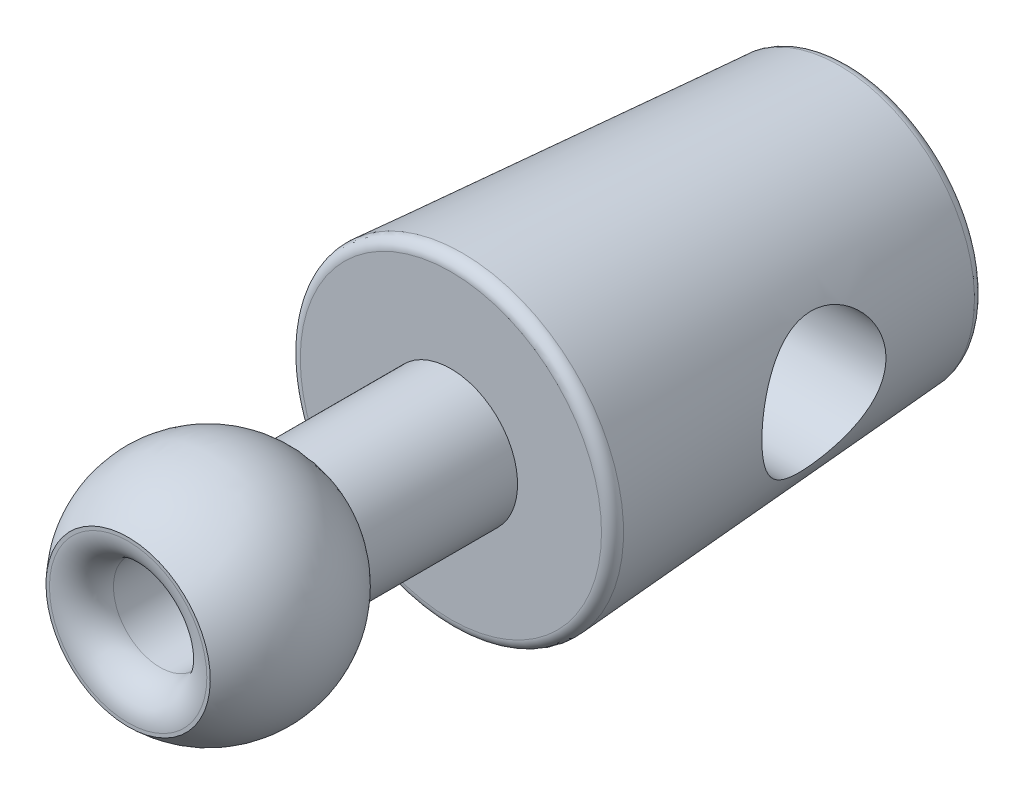
ISO-10303-21;
HEADER;
FILE_DESCRIPTION(('STEP AP214'),'2;1');
FILE_NAME('part.step','',(''),(''),'','','');
FILE_SCHEMA(('AUTOMOTIVE_DESIGN { 1 0 10303 214 1 1 1 1 }'));
ENDSEC;
DATA;
#1=APPLICATION_CONTEXT('core data for automotive mechanical design processes');
#2=APPLICATION_PROTOCOL_DEFINITION('international standard','automotive_design',2000,#1);
#3=PRODUCT_CONTEXT('',#1,'mechanical');
#4=PRODUCT('Part','Part','',(#3));
#5=PRODUCT_RELATED_PRODUCT_CATEGORY('part','',(#4));
#6=PRODUCT_DEFINITION_FORMATION('','',#4);
#7=PRODUCT_DEFINITION_CONTEXT('part definition',#1,'design');
#8=PRODUCT_DEFINITION('design','',#6,#7);
#9=PRODUCT_DEFINITION_SHAPE('','',#8);
#10=(LENGTH_UNIT() NAMED_UNIT(*) SI_UNIT(.MILLI.,.METRE.));
#11=(NAMED_UNIT(*) PLANE_ANGLE_UNIT() SI_UNIT($,.RADIAN.));
#12=(NAMED_UNIT(*) SI_UNIT($,.STERADIAN.) SOLID_ANGLE_UNIT());
#13=UNCERTAINTY_MEASURE_WITH_UNIT(LENGTH_MEASURE(1.E-05),#10,'distance_accuracy_value','');
#14=(GEOMETRIC_REPRESENTATION_CONTEXT(3) GLOBAL_UNCERTAINTY_ASSIGNED_CONTEXT((#13)) GLOBAL_UNIT_ASSIGNED_CONTEXT((#10,
#11,#12)) REPRESENTATION_CONTEXT('',''));
#15=CARTESIAN_POINT('',(0.,0.,0.));
#16=DIRECTION('',(0.,0.,1.));
#17=DIRECTION('',(1.,0.,0.));
#18=AXIS2_PLACEMENT_3D('',#15,#16,#17);
#19=CARTESIAN_POINT('',(0.,0.,24.5985711369072));
#20=DIRECTION('',(1.,0.,0.));
#21=DIRECTION('',(0.,1.,0.));
#22=AXIS2_PLACEMENT_3D('',#19,#20,#21);
#23=SPHERICAL_SURFACE('',#22,4.30000000000001);
#24=CARTESIAN_POINT('',(-4.30000000000001,0.,24.5985711369072));
#25=VERTEX_POINT('',#24);
#26=VERTEX_LOOP('',#25);
#27=FACE_BOUND('',#26,.T.);
#28=CARTESIAN_POINT('',(0.,0.,21.1));
#29=DIRECTION('',(0.,0.,-1.));
#30=DIRECTION('',(-1.,0.,0.));
#31=AXIS2_PLACEMENT_3D('',#28,#29,#30);
#32=CIRCLE('',#31,2.5);
#33=CARTESIAN_POINT('',(-2.5,0.,21.1));
#34=VERTEX_POINT('',#33);
#35=EDGE_CURVE('E42',#34,#34,#32,.T.);
#36=ORIENTED_EDGE('',*,*,#35,.F.);
#37=EDGE_LOOP('',(#36));
#38=FACE_BOUND('',#37,.T.);
#39=CARTESIAN_POINT('',(4.30000000000001,0.,24.5985711369072));
#40=VERTEX_POINT('',#39);
#41=VERTEX_LOOP('',#40);
#42=FACE_BOUND('',#41,.T.);
#43=CARTESIAN_POINT('',(-3.07919222845758,0.,27.6));
#44=CARTESIAN_POINT('',(-3.07918455866549,-0.172959588372303,27.6));
#45=CARTESIAN_POINT('',(-3.0645705053725,-0.346044588745784,27.6));
#46=CARTESIAN_POINT('',(-3.00647494735207,-0.687447719529803,27.6));
#47=CARTESIAN_POINT('',(-2.96295869927125,-0.855759858261048,27.6));
#48=CARTESIAN_POINT('',(-2.84829755842948,-1.18262181510949,27.6));
#49=CARTESIAN_POINT('',(-2.77716586086223,-1.34117625378863,27.6));
#50=CARTESIAN_POINT('',(-2.60931111376206,-1.64404818005578,27.6));
#51=CARTESIAN_POINT('',(-2.5125944276813,-1.78836919551885,27.6));
#52=CARTESIAN_POINT('',(-2.29629560659719,-2.05874345650688,27.6));
#53=CARTESIAN_POINT('',(-2.17671107999415,-2.18479478889765,27.6));
#54=CARTESIAN_POINT('',(-1.91807240394047,-2.41503644050156,27.6));
#55=CARTESIAN_POINT('',(-1.77901749027921,-2.51922590123731,27.6));
#56=CARTESIAN_POINT('',(-1.48539190581284,-2.70277854283356,27.6));
#57=CARTESIAN_POINT('',(-1.33082152402598,-2.78214218602985,27.6));
#58=CARTESIAN_POINT('',(-1.0105509525099,-2.91379268414682,27.6));
#59=CARTESIAN_POINT('',(-0.844850785161218,-2.96607959351339,27.5999999999999));
#60=CARTESIAN_POINT('',(-0.507023777754965,-3.04209269806712,27.5999999999999));
#61=CARTESIAN_POINT('',(-0.334896925446462,-3.06581883880717,27.6));
#62=CARTESIAN_POINT('',(0.0108966570196182,-3.08403668349851,27.6));
#63=CARTESIAN_POINT('',(0.184563384401932,-3.07852844012726,27.6));
#64=CARTESIAN_POINT('',(0.528507209977839,-3.03843399613189,27.6));
#65=CARTESIAN_POINT('',(0.698784306906579,-3.00384778465744,27.6));
#66=CARTESIAN_POINT('',(1.03111531936608,-2.90657913750276,27.6));
#67=CARTESIAN_POINT('',(1.19316922621619,-2.84389667216394,27.6));
#68=CARTESIAN_POINT('',(1.50445337537847,-2.69221490714335,27.6));
#69=CARTESIAN_POINT('',(1.65368362186371,-2.60321561602565,27.6));
#70=CARTESIAN_POINT('',(1.9350842429076,-2.40142666209564,27.6));
#71=CARTESIAN_POINT('',(2.06725462437148,-2.2886370089129,27.6));
#72=CARTESIAN_POINT('',(2.31078367607008,-2.04246905756035,27.6));
#73=CARTESIAN_POINT('',(2.42214234345272,-1.90909075656905,27.6));
#74=CARTESIAN_POINT('',(2.62088681273378,-1.62553171959825,27.6));
#75=CARTESIAN_POINT('',(2.70827261149935,-1.47535098142297,27.6));
#76=CARTESIAN_POINT('',(2.85659069484306,-1.1624502811626,27.6));
#77=CARTESIAN_POINT('',(2.91752298055383,-0.999730319614403,27.6));
#78=CARTESIAN_POINT('',(3.01120435263016,-0.66637031598095,27.6));
#79=CARTESIAN_POINT('',(3.04395344026539,-0.495730274252501,27.6));
#80=CARTESIAN_POINT('',(3.08033877058153,-0.151374072305169,27.6));
#81=CARTESIAN_POINT('',(3.08397501326243,0.0223420879137141,27.6));
#82=CARTESIAN_POINT('',(3.06203143093527,0.367919243830088,27.6));
#83=CARTESIAN_POINT('',(3.036451604611,0.539780239444002,27.6));
#84=CARTESIAN_POINT('',(2.95680201649472,0.876768436838341,27.6));
#85=CARTESIAN_POINT('',(2.90273225348289,1.04189563833045,27.6));
#86=CARTESIAN_POINT('',(2.76763768191726,1.36072874240077,27.6));
#87=CARTESIAN_POINT('',(2.68661287688603,1.51443464647155,27.6));
#88=CARTESIAN_POINT('',(2.4999082880904,1.80606190139979,27.6));
#89=CARTESIAN_POINT('',(2.39422850770476,1.94398325442039,27.6));
#90=CARTESIAN_POINT('',(2.16121385182741,2.2001263035129,27.6));
#91=CARTESIAN_POINT('',(2.03387896757047,2.31834799161104,27.6));
#92=CARTESIAN_POINT('',(1.7611687534057,2.5317357102118,27.6));
#93=CARTESIAN_POINT('',(1.61579341762715,2.62690173321162,27.6000000000001));
#94=CARTESIAN_POINT('',(1.31112927738108,2.791476498014,27.6));
#95=CARTESIAN_POINT('',(1.1518404876009,2.86088526700606,27.5999999999998));
#96=CARTESIAN_POINT('',(0.823871104880759,2.97197533672089,27.5999999999998));
#97=CARTESIAN_POINT('',(0.655190515445349,3.01365664779007,27.6));
#98=CARTESIAN_POINT('',(0.313225506273841,3.06810868211634,27.6));
#99=CARTESIAN_POINT('',(0.139941078242636,3.08087935327923,27.6));
#100=CARTESIAN_POINT('',(-0.206311938849315,3.0771474433527,27.5999999999999));
#101=CARTESIAN_POINT('',(-0.379280528511532,3.06064491806842,27.6));
#102=CARTESIAN_POINT('',(-0.7199924855964,2.99883508929425,27.6));
#103=CARTESIAN_POINT('',(-0.887735842511414,2.95352772788345,27.6));
#104=CARTESIAN_POINT('',(-1.2132382529594,2.83539332610845,27.6));
#105=CARTESIAN_POINT('',(-1.37099712048012,2.76256577321583,27.6));
#106=CARTESIAN_POINT('',(-1.67204277648461,2.59146143111743,27.6));
#107=CARTESIAN_POINT('',(-1.81533013288979,2.49318564114464,27.6));
#108=CARTESIAN_POINT('',(-2.0833582324521,2.27398628244982,27.6));
#109=CARTESIAN_POINT('',(-2.20810091456986,2.15306508443722,27.6));
#110=CARTESIAN_POINT('',(-2.43554640303014,1.8919613318332,27.6));
#111=CARTESIAN_POINT('',(-2.53824372373289,1.75177399736917,27.6));
#112=CARTESIAN_POINT('',(-2.71868393444657,1.4560930097972,27.6));
#113=CARTESIAN_POINT('',(-2.79641488629822,1.30059208048951,27.6));
#114=CARTESIAN_POINT('',(-2.92457758220253,0.978869350566099,27.6));
#115=CARTESIAN_POINT('',(-2.97504205018985,0.812660670351451,27.6));
#116=CARTESIAN_POINT('',(-3.0337893687938,0.537827279616599,27.6));
#117=CARTESIAN_POINT('',(-3.05079419229396,0.430988375070737,27.6));
#118=CARTESIAN_POINT('',(-3.07349801855296,0.21611597148691,27.6));
#119=CARTESIAN_POINT('',(-3.07919702131179,0.108082472448944,27.6));
#120=CARTESIAN_POINT('',(-3.07919222845758,0.,27.6));
#121=B_SPLINE_CURVE_WITH_KNOTS('',3,(#43,#44,#45,#46,#47,#48,#49,#50,#51,#52,#53,#54,#55,#56,
#57,#58,#59,#60,#61,#62,#63,#64,#65,#66,#67,#68,#69,#70,#71,#72,#73,#74,#75,#76,#77,#78,#79,#80,
#81,#82,#83,#84,#85,#86,#87,#88,#89,#90,#91,#92,#93,#94,#95,#96,#97,#98,#99,#100,#101,#102,#103,
#104,#105,#106,#107,#108,#109,#110,#111,#112,#113,#114,#115,#116,#117,#118,#119,#120),
.UNSPECIFIED.,.T.,.F.,(4,2,2,2,2,2,2,2,2,2,2,2,2,2,2,2,2,2,2,2,2,2,2,2,2,2,2,2,2,2,2,2,2,2,2,2,
2,2,4),(0.,0.518484264318586,1.03759292983048,1.55645385989739,2.07518586094655,
2.59397214252379,3.11277879211843,3.63157577930554,4.1503717232917,4.66916865628839,
5.18796465446506,5.70676084622869,6.22555758563839,6.74435415622072,7.26315051681171,
7.78194694849938,8.30074344798503,8.81953992525782,9.33833637915835,9.85713283305888,
10.3759293103317,10.8947258098173,11.413522241505,11.932318602096,12.4511151726783,
12.969911912088,13.4887081038515,14.0075041020282,14.5263010350249,15.0450969790111,
15.5638939661983,16.0827006157929,16.6014868973702,17.1202188984193,17.6390798284862,
18.1581884939981,18.6766727583167,19.0006736520561,19.3246745457956),.UNSPECIFIED.);
#122=CARTESIAN_POINT('',(-3.07919222845758,0.,27.6));
#123=VERTEX_POINT('',#122);
#124=EDGE_CURVE('E22',#123,#123,#121,.T.);
#125=ORIENTED_EDGE('',*,*,#124,.F.);
#126=EDGE_LOOP('',(#125));
#127=FACE_BOUND('',#126,.T.);
#128=ADVANCED_FACE('F17',(#27,#38,#42,#127),#23,.T.);
#129=CARTESIAN_POINT('',(0.,3.07919222845754,27.6));
#130=DIRECTION('',(0.,0.,1.));
#131=DIRECTION('',(1.,0.,0.));
#132=AXIS2_PLACEMENT_3D('',#129,#130,#131);
#133=PLANE('',#132);
#134=CARTESIAN_POINT('',(0.,0.,27.6));
#135=DIRECTION('',(0.,0.,1.));
#136=DIRECTION('',(1.,0.,0.));
#137=AXIS2_PLACEMENT_3D('',#134,#135,#136);
#138=CIRCLE('',#137,2.95);
#139=CARTESIAN_POINT('',(2.95,0.,27.6));
#140=VERTEX_POINT('',#139);
#141=EDGE_CURVE('E47',#140,#140,#138,.T.);
#142=ORIENTED_EDGE('',*,*,#141,.F.);
#143=EDGE_LOOP('',(#142));
#144=FACE_BOUND('',#143,.T.);
#145=ORIENTED_EDGE('',*,*,#124,.T.);
#146=EDGE_LOOP('',(#145));
#147=FACE_BOUND('',#146,.T.);
#148=ADVANCED_FACE('F39',(#144,#147),#133,.T.);
#149=CARTESIAN_POINT('',(0.,0.,18.3));
#150=DIRECTION('',(0.,0.,-1.));
#151=DIRECTION('',(-1.,0.,0.));
#152=AXIS2_PLACEMENT_3D('',#149,#150,#151);
#153=CYLINDRICAL_SURFACE('',#152,2.5);
#154=ORIENTED_EDGE('',*,*,#35,.T.);
#155=EDGE_LOOP('',(#154));
#156=FACE_BOUND('',#155,.T.);
#157=CARTESIAN_POINT('',(0.,0.,15.5));
#158=DIRECTION('',(0.,0.,-1.));
#159=DIRECTION('',(-1.,0.,0.));
#160=AXIS2_PLACEMENT_3D('',#157,#158,#159);
#161=CIRCLE('',#160,2.5);
#162=CARTESIAN_POINT('',(-2.5,0.,15.5));
#163=VERTEX_POINT('',#162);
#164=EDGE_CURVE('E50',#163,#163,#161,.T.);
#165=ORIENTED_EDGE('',*,*,#164,.F.);
#166=EDGE_LOOP('',(#165));
#167=FACE_BOUND('',#166,.T.);
#168=ADVANCED_FACE('F150',(#156,#167),#153,.T.);
#169=CARTESIAN_POINT('',(0.,0.,26.4));
#170=DIRECTION('',(0.,0.,-1.));
#171=DIRECTION('',(-1.,0.,0.));
#172=AXIS2_PLACEMENT_3D('',#169,#170,#171);
#173=TOROIDAL_SURFACE('',#172,2.95,1.2);
#174=CARTESIAN_POINT('',(0.,0.,26.4));
#175=DIRECTION('',(0.,0.,-1.));
#176=DIRECTION('',(-1.,0.,0.));
#177=AXIS2_PLACEMENT_3D('',#174,#175,#176);
#178=CIRCLE('',#177,1.75);
#179=CARTESIAN_POINT('',(-1.75,0.,26.4));
#180=VERTEX_POINT('',#179);
#181=EDGE_CURVE('E57',#180,#180,#178,.T.);
#182=ORIENTED_EDGE('',*,*,#181,.T.);
#183=EDGE_LOOP('',(#182));
#184=FACE_BOUND('',#183,.T.);
#185=ORIENTED_EDGE('',*,*,#141,.T.);
#186=EDGE_LOOP('',(#185));
#187=FACE_BOUND('',#186,.T.);
#188=ADVANCED_FACE('F142',(#184,#187),#173,.T.);
#189=CARTESIAN_POINT('',(0.,0.,20.));
#190=DIRECTION('',(1.,0.,0.));
#191=DIRECTION('',(0.,1.,0.));
#192=AXIS2_PLACEMENT_3D('',#189,#190,#191);
#193=SPHERICAL_SURFACE('',#192,20.);
#194=CARTESIAN_POINT('',(0.,0.,0.0767096091032204));
#195=DIRECTION('',(0.,0.,-1.));
#196=DIRECTION('',(-1.,0.,0.));
#197=AXIS2_PLACEMENT_3D('',#194,#195,#196);
#198=CIRCLE('',#197,1.75);
#199=CARTESIAN_POINT('',(-1.75,0.,0.0767096091032204));
#200=VERTEX_POINT('',#199);
#201=EDGE_CURVE('E54',#200,#200,#198,.F.);
#202=ORIENTED_EDGE('',*,*,#201,.T.);
#203=EDGE_LOOP('',(#202));
#204=FACE_BOUND('',#203,.T.);
#205=CARTESIAN_POINT('',(0.,0.,0.574961974548525));
#206=DIRECTION('',(0.,0.,-1.));
#207=DIRECTION('',(-1.,0.,0.));
#208=AXIS2_PLACEMENT_3D('',#205,#206,#207);
#209=CIRCLE('',#208,4.76108156932481);
#210=CARTESIAN_POINT('',(-4.76108156932481,0.,0.574961974548525));
#211=VERTEX_POINT('',#210);
#212=EDGE_CURVE('E58',#211,#211,#209,.F.);
#213=ORIENTED_EDGE('',*,*,#212,.F.);
#214=EDGE_LOOP('',(#213));
#215=FACE_BOUND('',#214,.T.);
#216=ADVANCED_FACE('F140',(#204,#215),#193,.T.);
#217=CARTESIAN_POINT('',(0.,6.075,15.5));
#218=DIRECTION('',(0.,0.,1.));
#219=DIRECTION('',(1.,0.,0.));
#220=AXIS2_PLACEMENT_3D('',#217,#218,#219);
#221=PLANE('',#220);
#222=ORIENTED_EDGE('',*,*,#164,.T.);
#223=EDGE_LOOP('',(#222));
#224=FACE_BOUND('',#223,.T.);
#225=CARTESIAN_POINT('',(0.,0.,15.5));
#226=DIRECTION('',(0.,0.,-1.));
#227=DIRECTION('',(1.,0.,0.));
#228=AXIS2_PLACEMENT_3D('',#225,#226,#227);
#229=CIRCLE('',#228,5.64629719986175);
#230=CARTESIAN_POINT('',(5.64629719986175,0.,15.5));
#231=VERTEX_POINT('',#230);
#232=EDGE_CURVE('E61',#231,#231,#229,.T.);
#233=ORIENTED_EDGE('',*,*,#232,.F.);
#234=EDGE_LOOP('',(#233));
#235=FACE_BOUND('',#234,.T.);
#236=ADVANCED_FACE('F126',(#224,#235),#221,.T.);
#237=CARTESIAN_POINT('',(0.,0.,27.6));
#238=DIRECTION('',(0.,0.,-1.));
#239=DIRECTION('',(-1.,0.,0.));
#240=AXIS2_PLACEMENT_3D('',#237,#238,#239);
#241=CYLINDRICAL_SURFACE('',#240,1.75);
#242=ORIENTED_EDGE('',*,*,#201,.F.);
#243=EDGE_LOOP('',(#242));
#244=FACE_BOUND('',#243,.T.);
#245=CARTESIAN_POINT('',(1.75,0.,4.5));
#246=CARTESIAN_POINT('',(1.74999492400056,0.0869569369157632,4.50000482747102));
#247=CARTESIAN_POINT('',(1.74347659641736,0.173959212864072,4.50457965455225));
#248=CARTESIAN_POINT('',(1.71780776572024,0.345184892500011,4.52244443119674));
#249=CARTESIAN_POINT('',(1.69864462942553,0.429405428552555,4.5357430964982));
#250=CARTESIAN_POINT('',(1.64891482593608,0.592282308152106,4.56975444757492));
#251=CARTESIAN_POINT('',(1.61840682184815,0.670964841208802,4.59042897160863));
#252=CARTESIAN_POINT('',(1.54733800219095,0.821703812558148,4.6375756081134));
#253=CARTESIAN_POINT('',(1.50677671424551,0.893759939275991,4.66404799300321));
#254=CARTESIAN_POINT('',(1.41289322680047,1.03641632840374,4.72352724979526));
#255=CARTESIAN_POINT('',(1.35875998210465,1.10632493439483,4.75690488346823));
#256=CARTESIAN_POINT('',(1.24128616383636,1.23669876786289,4.82605538821213));
#257=CARTESIAN_POINT('',(1.17793204260112,1.29714982399364,4.86183174112197));
#258=CARTESIAN_POINT('',(1.03097406374091,1.41780418124321,4.93945959222574));
#259=CARTESIAN_POINT('',(0.945768489473834,1.47609366483672,4.9812728097435));
#260=CARTESIAN_POINT('',(0.764522063261355,1.57757729381509,5.05954878008865));
#261=CARTESIAN_POINT('',(0.668496266030416,1.62079207849674,5.09601880844186));
#262=CARTESIAN_POINT('',(0.497703684131471,1.67936511681897,5.1477661818612));
#263=CARTESIAN_POINT('',(0.425407489542291,1.69920041430979,5.16611404402027));
#264=CARTESIAN_POINT('',(0.277437409672626,1.72950332600495,5.19465656549517));
#265=CARTESIAN_POINT('',(0.201776860258603,1.74000497218655,5.20488083015378));
#266=CARTESIAN_POINT('',(0.104666062138608,1.74699341380859,5.21170044266283));
#267=CARTESIAN_POINT('',(0.083768602078899,1.74811914410391,5.21280074780662));
#268=CARTESIAN_POINT('',(0.0419175190133179,1.74962341350058,5.21427369870263));
#269=CARTESIAN_POINT('',(0.0209638844717,1.75000178511394,5.21464618134485));
#270=CARTESIAN_POINT('',(-0.083860543998042,1.74999285911794,5.21462973815674));
#271=CARTESIAN_POINT('',(-0.167885106459199,1.74390248433516,5.20860352759914));
#272=CARTESIAN_POINT('',(-0.332857877826412,1.72009186254785,5.18574216500699));
#273=CARTESIAN_POINT('',(-0.413794047374316,1.70233021899039,5.16886854317544));
#274=CARTESIAN_POINT('',(-0.569518761068243,1.65670188410092,5.12749760393899));
#275=CARTESIAN_POINT('',(-0.644367512383599,1.62895427351091,5.10309058967147));
#276=CARTESIAN_POINT('',(-0.788151949848143,1.5644589455481,5.04955811201452));
#277=CARTESIAN_POINT('',(-0.857088692797953,1.52771284124708,5.02043349461999));
#278=CARTESIAN_POINT('',(-1.00034565717911,1.43878719929256,4.95464968273128));
#279=CARTESIAN_POINT('',(-1.07349220564001,1.38503153258772,4.91756453150074));
#280=CARTESIAN_POINT('',(-1.21077781581048,1.26678114568583,4.84358072362328));
#281=CARTESIAN_POINT('',(-1.27490522481436,1.20227276379257,4.80668236655011));
#282=CARTESIAN_POINT('',(-1.40296573004803,1.05144362519146,4.73003068972678));
#283=CARTESIAN_POINT('',(-1.46508832623932,0.96327941958257,4.69082509527451));
#284=CARTESIAN_POINT('',(-1.57301949989136,0.774506838868614,4.62088106337039));
#285=CARTESIAN_POINT('',(-1.61886075304043,0.67392394069431,4.59012569524216));
#286=CARTESIAN_POINT('',(-1.68149472067835,0.491641579682474,4.54754061816039));
#287=CARTESIAN_POINT('',(-1.70278492205977,0.412145168340857,4.53284509840262));
#288=CARTESIAN_POINT('',(-1.73402186913817,0.249941763870443,4.51118467104799));
#289=CARTESIAN_POINT('',(-1.74397768420286,0.167237392513442,4.50421358275873));
#290=CARTESIAN_POINT('',(-1.75198591033893,0.00080598083667672,4.49861106961515));
#291=CARTESIAN_POINT('',(-1.75001520073119,-0.0829227316425926,4.49999584336252));
#292=CARTESIAN_POINT('',(-1.73423806966824,-0.248708313021573,4.51101419343146));
#293=CARTESIAN_POINT('',(-1.72042833986061,-0.330764708038389,4.52065007548132));
#294=CARTESIAN_POINT('',(-1.68219398544299,-0.489091688137647,4.54702405194715));
#295=CARTESIAN_POINT('',(-1.65801877299388,-0.565451572307606,4.56359506347218));
#296=CARTESIAN_POINT('',(-1.60018684155266,-0.712866140961318,4.60257583042667));
#297=CARTESIAN_POINT('',(-1.5665282621223,-0.783919781007424,4.62498673145542));
#298=CARTESIAN_POINT('',(-1.48659822807929,-0.927364949163264,4.67697429586199));
#299=CARTESIAN_POINT('',(-1.43933513419556,-0.999011536042556,4.70707291376929));
#300=CARTESIAN_POINT('',(-1.33575189450824,-1.13380163127657,4.7706369566256));
#301=CARTESIAN_POINT('',(-1.27942199431291,-1.19693584575929,4.80410599290733));
#302=CARTESIAN_POINT('',(-1.14786837999737,-1.32466883832791,4.87829590601359));
#303=CARTESIAN_POINT('',(-1.07106702759343,-1.38751554144659,4.91924441366208));
#304=CARTESIAN_POINT('',(-0.907075446157857,-1.49986256949759,4.9987159431364));
#305=CARTESIAN_POINT('',(-0.819887906915573,-1.54936633916186,5.03723958901408));
#306=CARTESIAN_POINT('',(-0.657139043982734,-1.62379388736981,5.09866832524787));
#307=CARTESIAN_POINT('',(-0.583562032567944,-1.65175509984712,5.12312429464974));
#308=CARTESIAN_POINT('',(-0.431452995968913,-1.69783361542734,5.16469906434441));
#309=CARTESIAN_POINT('',(-0.352930551781941,-1.71596933653056,5.18183157972345));
#310=CARTESIAN_POINT('',(-0.191710058823337,-1.74139482072541,5.20615603027246));
#311=CARTESIAN_POINT('',(-0.108977775145793,-1.74857288029429,5.21324553410854));
#312=CARTESIAN_POINT('',(0.0568288508622788,-1.75103859745135,5.21565946551901));
#313=CARTESIAN_POINT('',(0.139903058295787,-1.74633056523074,5.21098815785658));
#314=CARTESIAN_POINT('',(0.291790795699492,-1.72696238599671,5.19231238222016));
#315=CARTESIAN_POINT('',(0.360981605853399,-1.7137763903009,5.17969533008122));
#316=CARTESIAN_POINT('',(0.49596203481508,-1.67969493107943,5.14820004084626));
#317=CARTESIAN_POINT('',(0.561747994776377,-1.65879136264824,5.12931522353011));
#318=CARTESIAN_POINT('',(0.719230128674069,-1.59852879707296,5.07725825987755));
#319=CARTESIAN_POINT('',(0.80853286764718,-1.55511466867657,5.0415465116921));
#320=CARTESIAN_POINT('',(0.97742799383802,-1.45492584545052,4.96600359572955));
#321=CARTESIAN_POINT('',(1.05700103681675,-1.39812517148842,4.92616450338893));
#322=CARTESIAN_POINT('',(1.20709828443609,-1.27093034172314,4.84581647387334));
#323=CARTESIAN_POINT('',(1.27742427503219,-1.20030073112915,4.80530902239038));
#324=CARTESIAN_POINT('',(1.40585242578022,-1.04692560576795,4.72815161995228));
#325=CARTESIAN_POINT('',(1.46397063369117,-0.964196242663902,4.69149663682254));
#326=CARTESIAN_POINT('',(1.5577889924531,-0.801939959635098,4.6307914179696));
#327=CARTESIAN_POINT('',(1.59559100422357,-0.724035803641569,4.60566216208033));
#328=CARTESIAN_POINT('',(1.65965123438312,-0.561809465674799,4.56250567503037));
#329=CARTESIAN_POINT('',(1.6859274615804,-0.477497539333747,4.54446736901372));
#330=CARTESIAN_POINT('',(1.72032846074071,-0.327465244023099,4.5207011123834));
#331=CARTESIAN_POINT('',(1.73141615104621,-0.262726808695235,4.51297893959179));
#332=CARTESIAN_POINT('',(1.74625403965325,-0.132001002235259,4.50262641759665));
#333=CARTESIAN_POINT('',(1.75000385345707,-0.0660135658395981,4.49999633521387));
#334=CARTESIAN_POINT('',(1.75,0.,4.5));
#335=B_SPLINE_CURVE_WITH_KNOTS('',3,(#245,#246,#247,#248,#249,#250,#251,#252,#253,#254,#255,
#256,#257,#258,#259,#260,#261,#262,#263,#264,#265,#266,#267,#268,#269,#270,#271,#272,#273,#274,
#275,#276,#277,#278,#279,#280,#281,#282,#283,#284,#285,#286,#287,#288,#289,#290,#291,#292,#293,
#294,#295,#296,#297,#298,#299,#300,#301,#302,#303,#304,#305,#306,#307,#308,#309,#310,#311,#312,
#313,#314,#315,#316,#317,#318,#319,#320,#321,#322,#323,#324,#325,#326,#327,#328,#329,#330,#331,
#332,#333,#334),.UNSPECIFIED.,.T.,.F.,(4,2,2,2,2,2,2,2,2,2,2,2,2,2,2,2,2,2,2,2,2,2,2,2,2,2,2,2,
2,2,2,2,2,2,2,2,2,2,2,2,2,2,2,2,4),(0.,0.260599997844525,0.521460751057889,0.780990964511211,
1.04053337488862,1.32301697726988,1.60591988529978,1.93858321590982,2.27078928121863,
2.50147881306048,2.73132372199623,2.79417490521687,2.85704017220189,3.10851625217469,
3.36088913656537,3.61034716232093,3.85976050287341,4.15288225029517,4.44637929809659,
4.78874892814962,5.13042750747914,5.38015173094421,5.62967599332699,5.87968413648753,
6.1297621659005,6.37413366349919,6.61855313509427,6.89040599710007,7.16255330729404,
7.48330346036597,7.80397072619855,8.05036777671769,8.29630134077139,8.54472561826835,
8.79305982391093,9.00687902687789,9.22092342201174,9.53580125933583,9.8512952833094,
10.1727198504528,10.4937192069391,10.7631208889748,11.0321001236808,11.2299248673893,
11.4277599766477),.UNSPECIFIED.);
#336=CARTESIAN_POINT('',(1.75,0.,4.5));
#337=VERTEX_POINT('',#336);
#338=EDGE_CURVE('E62',#337,#337,#335,.T.);
#339=ORIENTED_EDGE('',*,*,#338,.T.);
#340=EDGE_LOOP('',(#339));
#341=FACE_BOUND('',#340,.T.);
#342=ADVANCED_FACE('F76',(#244,#341),#241,.F.);
#343=CARTESIAN_POINT('',(0.,0.,27.6));
#344=DIRECTION('',(0.,0.,-1.));
#345=DIRECTION('',(-1.,0.,0.));
#346=AXIS2_PLACEMENT_3D('',#343,#344,#345);
#347=CYLINDRICAL_SURFACE('',#346,1.75);
#348=CARTESIAN_POINT('',(1.75,0.,9.5));
#349=CARTESIAN_POINT('',(1.75000469429506,-0.0870282609977622,9.50000434796006));
#350=CARTESIAN_POINT('',(1.74347448332612,-0.174032380982711,9.49541946971084));
#351=CARTESIAN_POINT('',(1.71779144961892,-0.345234546915614,9.47754361671796));
#352=CARTESIAN_POINT('',(1.69863502291651,-0.429431784470064,9.46425015624656));
#353=CARTESIAN_POINT('',(1.64891674728167,-0.592281098477372,9.43024704277185));
#354=CARTESIAN_POINT('',(1.61841001775371,-0.670957824008174,9.4095732495199));
#355=CARTESIAN_POINT('',(1.54734182870357,-0.821695936618218,9.36242682943183));
#356=CARTESIAN_POINT('',(1.50677890672863,-0.893756359410642,9.33595335922501));
#357=CARTESIAN_POINT('',(1.41289390236241,-1.03641557219886,9.27647321825804));
#358=CARTESIAN_POINT('',(1.35876132311483,-1.10632312913797,9.24309603425251));
#359=CARTESIAN_POINT('',(1.24128795771289,-1.23669709454709,9.1739455397836));
#360=CARTESIAN_POINT('',(1.17793338146166,-1.29714907774101,9.13816868495509));
#361=CARTESIAN_POINT('',(1.03096124847189,-1.41781428762898,9.0605339689945));
#362=CARTESIAN_POINT('',(0.945739998277362,-1.47611167011606,9.01871445674721));
#363=CARTESIAN_POINT('',(0.764494218568624,-1.57759084274178,8.94043961659908));
#364=CARTESIAN_POINT('',(0.668488122039762,-1.62079792031517,8.90397537467105));
#365=CARTESIAN_POINT('',(0.498317345911616,-1.67915256372785,8.85242205334206));
#366=CARTESIAN_POINT('',(0.426669138749728,-1.69884831876845,8.83421297372549));
#367=CARTESIAN_POINT('',(0.279986452738025,-1.72907203488675,8.80575433600163));
#368=CARTESIAN_POINT('',(0.204958907582855,-1.73961794211677,8.79548920124733));
#369=CARTESIAN_POINT('',(0.0530029695707997,-1.75086279452758,8.78453095711429));
#370=CARTESIAN_POINT('',(-0.0239338198954597,-1.75150527489411,8.78389273644213));
#371=CARTESIAN_POINT('',(-0.176696727305762,-1.74273962124781,8.79245352711218));
#372=CARTESIAN_POINT('',(-0.252522045042584,-1.73332457501953,8.80165930392258));
#373=CARTESIAN_POINT('',(-0.39591395084295,-1.70608725242292,8.82745212795201));
#374=CARTESIAN_POINT('',(-0.463695287474455,-1.68886104427269,8.8435117514252));
#375=CARTESIAN_POINT('',(-0.59539366095286,-1.64705421402275,8.88095725884965));
#376=CARTESIAN_POINT('',(-0.659307550106497,-1.62246769567608,8.90234741070607));
#377=CARTESIAN_POINT('',(-0.815565173889041,-1.55181144035789,8.9608517928833));
#378=CARTESIAN_POINT('',(-0.905022849818615,-1.50126200470751,9.00029120888541));
#379=CARTESIAN_POINT('',(-1.07316242786492,-1.38608679426605,9.08176917630845));
#380=CARTESIAN_POINT('',(-1.15182187772028,-1.32143239286565,9.1238128871457));
#381=CARTESIAN_POINT('',(-1.29817073647833,-1.17807504925306,9.20659859906655));
#382=CARTESIAN_POINT('',(-1.36571843074515,-1.099214053765,9.24731915022406));
#383=CARTESIAN_POINT('',(-1.48673580993277,-0.928963692567987,9.32285537258176));
#384=CARTESIAN_POINT('',(-1.540234677336,-0.837600906421634,9.35768322976349));
#385=CARTESIAN_POINT('',(-1.62065021000659,-0.665516733758953,9.41108316140072));
#386=CARTESIAN_POINT('',(-1.65082867862021,-0.586906606535084,9.43154675843036));
#387=CARTESIAN_POINT('',(-1.69979221863997,-0.424695896147103,9.46505005998108));
#388=CARTESIAN_POINT('',(-1.71858505200436,-0.341098755596122,9.47809482179104));
#389=CARTESIAN_POINT('',(-1.74377814698336,-0.170800813050063,9.49563204181562));
#390=CARTESIAN_POINT('',(-1.75012812902888,-0.0840888547374762,9.50008980010101));
#391=CARTESIAN_POINT('',(-1.74986798010445,0.0893076943070936,9.49990747629802));
#392=CARTESIAN_POINT('',(-1.74325842805054,0.175992286088562,9.49526780060159));
#393=CARTESIAN_POINT('',(-1.71836140556582,0.340939403404566,9.47794153516328));
#394=CARTESIAN_POINT('',(-1.70086414151991,0.419382384877111,9.46579981659327));
#395=CARTESIAN_POINT('',(-1.65581330944924,0.571938195002418,9.4349433423669));
#396=CARTESIAN_POINT('',(-1.6282578801314,0.64605021925211,9.41622737014971));
#397=CARTESIAN_POINT('',(-1.56192079896845,0.793668876211798,9.37201207282582));
#398=CARTESIAN_POINT('',(-1.52248326924919,0.866762381283566,9.34612676171522));
#399=CARTESIAN_POINT('',(-1.43462988388947,1.0055308145808,9.29009133076977));
#400=CARTESIAN_POINT('',(-1.38620835623663,1.07120101374483,9.25993851953373));
#401=CARTESIAN_POINT('',(-1.2724698114728,1.20511693906215,9.19186052271138));
#402=CARTESIAN_POINT('',(-1.20567957718852,1.27188385566648,9.15348782697985));
#403=CARTESIAN_POINT('',(-1.06227137743555,1.393899046267,9.07659509409676));
#404=CARTESIAN_POINT('',(-0.985645698324498,1.44913818912645,9.03807496457043));
#405=CARTESIAN_POINT('',(-0.830986239537846,1.54250527860542,8.96818310684974));
#406=CARTESIAN_POINT('',(-0.753788682873495,1.58176473436308,8.93648005858767));
#407=CARTESIAN_POINT('',(-0.592415774087425,1.64898342663862,8.87957370070915));
#408=CARTESIAN_POINT('',(-0.508254972197106,1.67696554345845,8.85435726857246));
#409=CARTESIAN_POINT('',(-0.353479317872809,1.71535036280072,8.8188198962606));
#410=CARTESIAN_POINT('',(-0.283971871296085,1.72826935469528,8.80644015037245));
#411=CARTESIAN_POINT('',(-0.142981885387071,1.74559168259175,8.78970910747148));
#412=CARTESIAN_POINT('',(-0.0715015802357777,1.75000428031299,8.78534907886818));
#413=CARTESIAN_POINT('',(0.0839977718078681,1.74999497162506,8.78536653848789));
#414=CARTESIAN_POINT('',(0.168024904933596,1.74389429836519,8.79140423761551));
#415=CARTESIAN_POINT('',(0.332951450263619,1.72006627331317,8.81428252840844));
#416=CARTESIAN_POINT('',(0.413843739199533,1.70231391827562,8.83114635005053));
#417=CARTESIAN_POINT('',(0.569512870461174,1.656705331636,8.87249915798428));
#418=CARTESIAN_POINT('',(0.644347183845094,1.62896236436014,8.89690224702031));
#419=CARTESIAN_POINT('',(0.788130412476966,1.56446963545096,8.95043346259686));
#420=CARTESIAN_POINT('',(0.85707867173833,1.52771887168261,8.97956211474356));
#421=CARTESIAN_POINT('',(1.00035178726407,1.43878361743974,9.04535288419662));
#422=CARTESIAN_POINT('',(1.07350302129318,1.38502330874657,9.0824408686625));
#423=CARTESIAN_POINT('',(1.21078689095602,1.26677223525908,9.15642459510102));
#424=CARTESIAN_POINT('',(1.2749091901485,1.20226935361059,9.19332007091725));
#425=CARTESIAN_POINT('',(1.4029437975257,1.05146798758155,9.26995610776073));
#426=CARTESIAN_POINT('',(1.465049445746,0.963328792060763,9.30915014034395));
#427=CARTESIAN_POINT('',(1.57298822683531,0.774580073654289,9.37909824093952));
#428=CARTESIAN_POINT('',(1.61884357966364,0.673987834634045,9.40986382048429));
#429=CARTESIAN_POINT('',(1.68594535733785,0.478677106820929,9.45548436963229));
#430=CARTESIAN_POINT('',(1.70981325646805,0.385257948159354,9.47201020757895));
#431=CARTESIAN_POINT('',(1.74182805043758,0.194545783510176,9.494258787333));
#432=CARTESIAN_POINT('',(1.7499947539238,0.0972578168733601,9.49999514096802));
#433=CARTESIAN_POINT('',(1.75,0.,9.5));
#434=B_SPLINE_CURVE_WITH_KNOTS('',3,(#348,#349,#350,#351,#352,#353,#354,#355,#356,#357,#358,
#359,#360,#361,#362,#363,#364,#365,#366,#367,#368,#369,#370,#371,#372,#373,#374,#375,#376,#377,
#378,#379,#380,#381,#382,#383,#384,#385,#386,#387,#388,#389,#390,#391,#392,#393,#394,#395,#396,
#397,#398,#399,#400,#401,#402,#403,#404,#405,#406,#407,#408,#409,#410,#411,#412,#413,#414,#415,
#416,#417,#418,#419,#420,#421,#422,#423,#424,#425,#426,#427,#428,#429,#430,#431,#432,#433),
.UNSPECIFIED.,.T.,.F.,(4,2,2,2,2,2,2,2,2,2,2,2,2,2,2,2,2,2,2,2,2,2,2,2,2,2,2,2,2,2,2,2,2,2,2,2,
2,2,2,2,2,2,4),(0.,0.260693143948406,0.521460731092705,0.78097816357091,1.04053335933323,
1.32301320000159,1.60591987044089,1.93863471000181,2.27078930014016,2.49943937691713,
2.72763996797453,2.95714117634126,3.18680021506603,3.40129749524099,3.61596706826291,
3.94441405554682,4.27353394586102,4.60657118766853,4.93891106599444,5.19779535298112,
5.45650295094103,5.71625380651513,5.97599305900952,6.21878263455979,6.46161716183191,
6.72161742269341,6.98178239576077,7.28642200017632,7.59130200098469,7.86701082293018,
8.14215741576073,8.35660654484982,8.5708220506333,8.82247558211014,9.07467090814307,
9.32409271884131,9.57354229081049,9.86668523271935,10.1601610864563,10.5024200587367,
10.8442092184282,11.135913251873,11.4272490290514),.UNSPECIFIED.);
#435=CARTESIAN_POINT('',(1.75,0.,9.5));
#436=VERTEX_POINT('',#435);
#437=EDGE_CURVE('E70',#436,#436,#434,.T.);
#438=ORIENTED_EDGE('',*,*,#437,.T.);
#439=EDGE_LOOP('',(#438));
#440=FACE_BOUND('',#439,.T.);
#441=ORIENTED_EDGE('',*,*,#181,.F.);
#442=EDGE_LOOP('',(#441));
#443=FACE_BOUND('',#442,.T.);
#444=ADVANCED_FACE('F117',(#440,#443),#347,.F.);
#445=CARTESIAN_POINT('',(0.,0.,0.963462735057556));
#446=DIRECTION('',(0.,0.,-1.));
#447=DIRECTION('',(-1.,0.,0.));
#448=AXIS2_PLACEMENT_3D('',#445,#446,#447);
#449=TOROIDAL_SURFACE('',#448,4.66585993793832,0.4);
#450=CARTESIAN_POINT('',(0.,0.,0.935787280468503));
#451=DIRECTION('',(0.,0.,1.));
#452=DIRECTION('',(0.,1.,0.));
#453=AXIS2_PLACEMENT_3D('',#450,#451,#452);
#454=CIRCLE('',#453,5.06490137590987);
#455=CARTESIAN_POINT('',(0.,5.06490137590987,0.935787280468503));
#456=VERTEX_POINT('',#455);
#457=EDGE_CURVE('E105',#456,#456,#454,.T.);
#458=ORIENTED_EDGE('',*,*,#457,.F.);
#459=EDGE_LOOP('',(#458));
#460=FACE_BOUND('',#459,.T.);
#461=ORIENTED_EDGE('',*,*,#212,.T.);
#462=EDGE_LOOP('',(#461));
#463=FACE_BOUND('',#462,.T.);
#464=ADVANCED_FACE('F115',(#460,#463),#449,.T.);
#465=CARTESIAN_POINT('',(0.,0.,15.1));
#466=DIRECTION('',(0.,0.,-1.));
#467=DIRECTION('',(-1.,0.,0.));
#468=AXIS2_PLACEMENT_3D('',#465,#466,#467);
#469=TOROIDAL_SURFACE('',#468,5.64629719986175,0.4);
#470=ORIENTED_EDGE('',*,*,#232,.T.);
#471=EDGE_LOOP('',(#470));
#472=FACE_BOUND('',#471,.T.);
#473=CARTESIAN_POINT('',(0.,0.,15.0723245454287));
#474=DIRECTION('',(0.,0.,1.));
#475=DIRECTION('',(0.,1.,0.));
#476=AXIS2_PLACEMENT_3D('',#473,#474,#475);
#477=CIRCLE('',#476,6.04533863783274);
#478=CARTESIAN_POINT('',(0.,6.04533863783274,15.0723245454287));
#479=VERTEX_POINT('',#478);
#480=EDGE_CURVE('E101',#479,#479,#477,.F.);
#481=ORIENTED_EDGE('',*,*,#480,.F.);
#482=EDGE_LOOP('',(#481));
#483=FACE_BOUND('',#482,.T.);
#484=ADVANCED_FACE('F85',(#472,#483),#469,.T.);
#485=CARTESIAN_POINT('',(0.,0.,7.));
#486=DIRECTION('',(1.,0.,0.));
#487=DIRECTION('',(0.,0.,-1.));
#488=AXIS2_PLACEMENT_3D('',#485,#486,#487);
#489=CYLINDRICAL_SURFACE('',#488,2.5);
#490=CARTESIAN_POINT('',(4.87715916374774,-2.49875083054887,6.92097920000832));
#491=CARTESIAN_POINT('',(4.87878490616424,-2.49958421280208,6.947323123627));
#492=CARTESIAN_POINT('',(4.88062348658636,-2.50000127514159,6.97366525291096));
#493=CARTESIAN_POINT('',(4.89325052987398,-2.49999343365975,7.13560867977254));
#494=CARTESIAN_POINT('',(4.90951921560773,-2.48889367082328,7.27101301508072));
#495=CARTESIAN_POINT('',(4.9519074364025,-2.44538803864855,7.53698734489798));
#496=CARTESIAN_POINT('',(4.97805786188197,-2.41291511800735,7.66754075504113));
#497=CARTESIAN_POINT('',(5.03735927577602,-2.3284939459829,7.91960785011279));
#498=CARTESIAN_POINT('',(5.07047059896387,-2.27665480089945,8.04116769102018));
#499=CARTESIAN_POINT('',(5.14074821184517,-2.15522680910926,8.27365959953823));
#500=CARTESIAN_POINT('',(5.17791316963356,-2.08564378252601,8.38459513561775));
#501=CARTESIAN_POINT('',(5.25637293080717,-1.92392712209829,8.60261980602831));
#502=CARTESIAN_POINT('',(5.29775752380149,-1.83041818642241,8.70865934960312));
#503=CARTESIAN_POINT('',(5.37809055190024,-1.62628859443,8.90398209869118));
#504=CARTESIAN_POINT('',(5.4170379185192,-1.51566050583163,8.9932579888225));
#505=CARTESIAN_POINT('',(5.48997221870973,-1.27617302274262,9.1547150480664));
#506=CARTESIAN_POINT('',(5.52379133885244,-1.14689261237724,9.2263525658901));
#507=CARTESIAN_POINT('',(5.58159188944803,-0.875880181934121,9.34621676682582));
#508=CARTESIAN_POINT('',(5.60558171511642,-0.734158913780863,9.39446343458166));
#509=CARTESIAN_POINT('',(5.63938432789249,-0.456084322555453,9.4618215279898));
#510=CARTESIAN_POINT('',(5.6502842286896,-0.320407118310256,9.48317573232428));
#511=CARTESIAN_POINT('',(5.66055538695481,-0.0469793701675045,9.50330872014226));
#512=CARTESIAN_POINT('',(5.65993258157991,0.0907700694377633,9.50209912978014));
#513=CARTESIAN_POINT('',(5.6477566209343,0.352680269030778,9.47820890156947));
#514=CARTESIAN_POINT('',(5.6370829086473,0.477045737326767,9.45725571008324));
#515=CARTESIAN_POINT('',(5.60700845886268,0.720217466425677,9.39728451757275));
#516=CARTESIAN_POINT('',(5.58760686973106,0.83902318347934,9.35826475366818));
#517=CARTESIAN_POINT('',(5.54108705695673,1.07115050083081,9.2624761355709));
#518=CARTESIAN_POINT('',(5.51378965616049,1.18426346690464,9.20529171753156));
#519=CARTESIAN_POINT('',(5.45381167635237,1.39956584732143,9.07534212422109));
#520=CARTESIAN_POINT('',(5.42112908472004,1.50175115400913,9.00257112067652));
#521=CARTESIAN_POINT('',(5.34934369839634,1.70300730595561,8.8353546186188));
#522=CARTESIAN_POINT('',(5.30992560897347,1.80077923160708,8.73947999831689));
#523=CARTESIAN_POINT('',(5.23066417106812,1.97941235146384,8.53315680081476));
#524=CARTESIAN_POINT('',(5.19082054512896,2.06026170214836,8.42269810431422));
#525=CARTESIAN_POINT('',(5.11148072073545,2.20821553973103,8.18118171134813));
#526=CARTESIAN_POINT('',(5.07219880327548,2.27398409701691,8.04922801775469));
#527=CARTESIAN_POINT('',(5.00137303918928,2.38174662182713,7.77400304857743));
#528=CARTESIAN_POINT('',(4.96982400027925,2.42375656711712,7.63073945301306));
#529=CARTESIAN_POINT('',(4.91988337509997,2.47996373956263,7.34578991311464));
#530=CARTESIAN_POINT('',(4.90081481908595,2.49568116519481,7.20452689260236));
#531=CARTESIAN_POINT('',(4.87506191656191,2.50276018139068,6.92030968801043));
#532=CARTESIAN_POINT('',(4.86836714943764,2.49414228148081,6.77735702907617));
#533=CARTESIAN_POINT('',(4.86753322820506,2.45486328908964,6.5102034922838));
#534=CARTESIAN_POINT('',(4.87212597377567,2.42666227267739,6.38563422270084));
#535=CARTESIAN_POINT('',(4.88997700699582,2.35188339779902,6.14280154951508));
#536=CARTESIAN_POINT('',(4.90323716853692,2.30530156627196,6.0245395155154));
#537=CARTESIAN_POINT('',(4.9364457234083,2.19452548238847,5.79565321725962));
#538=CARTESIAN_POINT('',(4.95648148196468,2.13010326763721,5.68515274576665));
#539=CARTESIAN_POINT('',(5.00047315171231,1.98565457969491,5.47573870526193));
#540=CARTESIAN_POINT('',(5.02443061935405,1.90562190858998,5.37682976355737));
#541=CARTESIAN_POINT('',(5.07580435063199,1.72346332894458,5.1837107337168));
#542=CARTESIAN_POINT('',(5.10333390086843,1.61996680475254,5.09081967645924));
#543=CARTESIAN_POINT('',(5.15632949791883,1.39865998273261,4.92321841714749));
#544=CARTESIAN_POINT('',(5.18179507584888,1.28084644753948,4.84851233859543));
#545=CARTESIAN_POINT('',(5.2281931037275,1.03034665226254,4.71770834441464));
#546=CARTESIAN_POINT('',(5.24898917031057,0.897351398903675,4.6621497613998));
#547=CARTESIAN_POINT('',(5.28246437012672,0.622872530004912,4.57456153914276));
#548=CARTESIAN_POINT('',(5.29514787854692,0.481393534943564,4.54251921595962));
#549=CARTESIAN_POINT('',(5.3102330965362,0.203357615024312,4.50458317448757));
#550=CARTESIAN_POINT('',(5.31322066557091,0.0670352443282082,4.49719868710556));
#551=CARTESIAN_POINT('',(5.31021044067126,-0.204878401107109,4.5047017473477));
#552=CARTESIAN_POINT('',(5.30421429558942,-0.340469805422687,4.51958520795753));
#553=CARTESIAN_POINT('',(5.28435486819566,-0.601740237025797,4.56999061531617));
#554=CARTESIAN_POINT('',(5.27079895477266,-0.727600151895404,4.60470743761688));
#555=CARTESIAN_POINT('',(5.23752833892862,-0.971681530013175,4.69290574620048));
#556=CARTESIAN_POINT('',(5.21781251588528,-1.08990159867972,4.74639064702555));
#557=CARTESIAN_POINT('',(5.17335184834172,-1.32094059509872,4.87321315587678));
#558=CARTESIAN_POINT('',(5.14842773823913,-1.43331114440632,4.9473031227484));
#559=CARTESIAN_POINT('',(5.09691856294891,-1.64455905617304,5.11230158725509));
#560=CARTESIAN_POINT('',(5.07033267396401,-1.74342964768197,5.20321847103531));
#561=CARTESIAN_POINT('',(5.01701237110309,-1.93121191843027,5.40604735759946));
#562=CARTESIAN_POINT('',(4.99037102436959,-2.01912552531494,5.51891181873437));
#563=CARTESIAN_POINT('',(4.94268666828309,-2.17486152193225,5.75886984707003));
#564=CARTESIAN_POINT('',(4.921642582364,-2.24268777551192,5.88596067130898));
#565=CARTESIAN_POINT('',(4.89086057655589,-2.34908871385662,6.13518175886412));
#566=CARTESIAN_POINT('',(4.88007720863805,-2.39017972300363,6.25611052690252));
#567=CARTESIAN_POINT('',(4.86779006184343,-2.45341104379673,6.50307167486587));
#568=CARTESIAN_POINT('',(4.86626227214613,-2.47560026169109,6.62908999477716));
#569=CARTESIAN_POINT('',(4.87128944619002,-2.4934432650076,6.81076869948471));
#570=CARTESIAN_POINT('',(4.87375873778899,-2.49700771637616,6.8658778747192));
#571=CARTESIAN_POINT('',(4.87715916374774,-2.49875083054887,6.92097920000832));
#572=B_SPLINE_CURVE_WITH_KNOTS('',3,(#490,#491,#492,#493,#494,#495,#496,#497,#498,#499,#500,
#501,#502,#503,#504,#505,#506,#507,#508,#509,#510,#511,#512,#513,#514,#515,#516,#517,#518,#519,
#520,#521,#522,#523,#524,#525,#526,#527,#528,#529,#530,#531,#532,#533,#534,#535,#536,#537,#538,
#539,#540,#541,#542,#543,#544,#545,#546,#547,#548,#549,#550,#551,#552,#553,#554,#555,#556,#557,
#558,#559,#560,#561,#562,#563,#564,#565,#566,#567,#568,#569,#570,#571),.UNSPECIFIED.,.T.,.F.,(4,
2,2,2,2,2,2,2,2,2,2,2,2,2,2,2,2,2,2,2,2,2,2,2,2,2,2,2,2,2,2,2,2,2,2,2,2,2,2,2,4),(0.,
0.0792227159567007,0.487179999596916,0.896423255509922,1.30339484066474,1.71023310747125,
2.15021472881512,2.5903879069301,3.04278636558213,3.49479762048247,3.90587545502726,
4.31674148467126,4.69469990062638,5.07269520437058,5.46005009564671,5.84755008373795,
6.27323078436832,6.69920841523992,7.15462313872213,7.60973122859802,8.0374794355099,
8.46486724887968,8.84647468383189,9.22816464944662,9.61497672941479,10.0019427014926,
10.4253395777613,10.8488323713805,11.2834304060308,11.717793859366,12.1253691863201,
12.5328697168958,12.9248970155397,13.3169956740919,13.7258925547508,14.1349937715738,
14.5694695964225,15.003861794521,15.3866977810235,15.7685401876734,15.9342435470288),.UNSPECIFIED.);
#573=CARTESIAN_POINT('',(4.87715916374774,-2.49875083054887,6.92097920000832));
#574=VERTEX_POINT('',#573);
#575=EDGE_CURVE('E31',#574,#574,#572,.T.);
#576=ORIENTED_EDGE('',*,*,#575,.F.);
#577=EDGE_LOOP('',(#576));
#578=FACE_BOUND('',#577,.T.);
#579=ORIENTED_EDGE('',*,*,#437,.F.);
#580=EDGE_LOOP('',(#579));
#581=FACE_BOUND('',#580,.T.);
#582=ORIENTED_EDGE('',*,*,#338,.F.);
#583=EDGE_LOOP('',(#582));
#584=FACE_BOUND('',#583,.T.);
#585=CARTESIAN_POINT('',(-4.87715926366543,2.49875088173972,6.92098081875267));
#586=CARTESIAN_POINT('',(-4.88547253688203,2.50299327959756,7.05547017444391));
#587=CARTESIAN_POINT('',(-4.89941780466691,2.49632882099722,7.19008337044806));
#588=CARTESIAN_POINT('',(-4.93737806035192,2.46185510029413,7.45521689829528));
#589=CARTESIAN_POINT('',(-4.96141088878101,2.4340083045829,7.58572953630228));
#590=CARTESIAN_POINT('',(-5.01695889391315,2.35884609261722,7.83854120305598));
#591=CARTESIAN_POINT('',(-5.04843639718375,2.31162784840712,7.96087773336427));
#592=CARTESIAN_POINT('',(-5.11605097865236,2.1994075407254,8.19563790997605));
#593=CARTESIAN_POINT('',(-5.15218833423833,2.13440441831119,8.3080609654868));
#594=CARTESIAN_POINT('',(-5.22916020676019,1.98227073687771,8.52973623104617));
#595=CARTESIAN_POINT('',(-5.27013883299961,1.8937819020663,8.63800783867689));
#596=CARTESIAN_POINT('',(-5.35051709700738,1.69964048946731,8.83867384374726));
#597=CARTESIAN_POINT('',(-5.38991605666232,1.59398063686796,8.93106147736311));
#598=CARTESIAN_POINT('',(-5.46528696596921,1.36255559104661,9.10117480127271));
#599=CARTESIAN_POINT('',(-5.5010360502607,1.2361169659846,9.17809040124409));
#600=CARTESIAN_POINT('',(-5.56337584592575,0.969810108040594,9.30898947402973));
#601=CARTESIAN_POINT('',(-5.58997330753649,0.829951871266042,9.36298985599839));
#602=CARTESIAN_POINT('',(-5.62933186954737,0.553014351747765,9.44196130342014));
#603=CARTESIAN_POINT('',(-5.64304919519564,0.41664863388058,9.46895070686538));
#604=CARTESIAN_POINT('',(-5.65879768196399,0.140690789007044,9.49988948031449));
#605=CARTESIAN_POINT('',(-5.6608360722277,0.00110071159108873,9.50385310306635));
#606=CARTESIAN_POINT('',(-5.65337625692512,-0.264121576308965,9.48923874428776));
#607=CARTESIAN_POINT('',(-5.64488191759507,-0.389896865289658,9.47262238900161));
#608=CARTESIAN_POINT('',(-5.61879825681196,-0.636579780019256,9.42087796321116));
#609=CARTESIAN_POINT('',(-5.60120839578158,-0.757487116525927,9.38574879446135));
#610=CARTESIAN_POINT('',(-5.55814676275876,-0.992900067142035,9.29785529893512));
#611=CARTESIAN_POINT('',(-5.5325811707046,-1.10730923431599,9.24488042414714));
#612=CARTESIAN_POINT('',(-5.47564540798572,-1.3258114872565,9.12317675992319));
#613=CARTESIAN_POINT('',(-5.44427346009307,-1.42990139945202,9.05444314545969));
#614=CARTESIAN_POINT('',(-5.37484003312327,-1.63530813646138,8.89582611611962));
#615=CARTESIAN_POINT('',(-5.33642670456705,-1.73543779942251,8.80455947298574));
#616=CARTESIAN_POINT('',(-5.25843403416706,-1.91958093961838,8.60730776492671));
#617=CARTESIAN_POINT('',(-5.21885364684227,-2.00357942689176,8.50130916639316));
#618=CARTESIAN_POINT('',(-5.13874676388131,-2.15970419410389,8.26765907843608));
#619=CARTESIAN_POINT('',(-5.09839518144024,-2.23035587959244,8.13895614798409));
#620=CARTESIAN_POINT('',(-5.02447866652465,-2.34846351790131,7.86962871742244));
#621=CARTESIAN_POINT('',(-4.99090205383547,-2.39595959533391,7.72902533861662));
#622=CARTESIAN_POINT('',(-4.94419859042465,-2.45354434496375,7.48954525252623));
#623=CARTESIAN_POINT('',(-4.92801077412745,-2.47088143406973,7.39296193019417));
#624=CARTESIAN_POINT('',(-4.90110359083664,-2.49411051113061,7.19767754190371));
#625=CARTESIAN_POINT('',(-4.8903830218562,-2.50000501556443,7.09897694640942));
#626=CARTESIAN_POINT('',(-4.8726380450421,-2.49999346622871,6.87106282064986));
#627=CARTESIAN_POINT('',(-4.86771475273826,-2.48997529980247,6.74165666690154));
#628=CARTESIAN_POINT('',(-4.86810482055082,-2.45000134475073,6.48592454173862));
#629=CARTESIAN_POINT('',(-4.87342613965993,-2.42003006647656,6.35960104243786));
#630=CARTESIAN_POINT('',(-4.89285292393593,-2.34132176567613,6.11411954823429));
#631=CARTESIAN_POINT('',(-4.90693247244309,-2.29264027078182,5.99494154565549));
#632=CARTESIAN_POINT('',(-4.94150452833559,-2.17809445744708,5.76619021343935));
#633=CARTESIAN_POINT('',(-4.96199890690927,-2.11222512629571,5.65661969823329));
#634=CARTESIAN_POINT('',(-5.00778363521154,-1.96133088939034,5.4440385862664));
#635=CARTESIAN_POINT('',(-5.03326343214968,-1.87550882723985,5.34163557859431));
#636=CARTESIAN_POINT('',(-5.08507659566631,-1.6888035779498,5.15184519487266));
#637=CARTESIAN_POINT('',(-5.11141027105245,-1.58791489326982,5.06446332490631));
#638=CARTESIAN_POINT('',(-5.16373224142888,-1.36541928934418,4.90094787305194));
#639=CARTESIAN_POINT('',(-5.18956020519438,-1.24284524409005,4.82607110380933));
#640=CARTESIAN_POINT('',(-5.23542816468432,-0.985803178446566,4.69809084975107));
#641=CARTESIAN_POINT('',(-5.255469673561,-0.851338279539852,4.64498167120502));
#642=CARTESIAN_POINT('',(-5.28664986918103,-0.578790624118972,4.5639064071789));
#643=CARTESIAN_POINT('',(-5.29805475315074,-0.440964275322514,4.53518490603396));
#644=CARTESIAN_POINT('',(-5.31154866792445,-0.162017976936484,4.50130701798626));
#645=CARTESIAN_POINT('',(-5.31364175206024,-0.0208994872782784,4.49614037786775));
#646=CARTESIAN_POINT('',(-5.30842715966744,0.25116220585366,4.50915696122717));
#647=CARTESIAN_POINT('',(-5.30170046694338,0.382188799236617,4.52589699485132));
#648=CARTESIAN_POINT('',(-5.28061354433045,0.639381332458484,4.57957601404355));
#649=CARTESIAN_POINT('',(-5.26625290728064,0.765547012652737,4.61651607699519));
#650=CARTESIAN_POINT('',(-5.23133429508887,1.01078005939417,4.70965643698674));
#651=CARTESIAN_POINT('',(-5.21072747845595,1.12978228684337,4.76600902070319));
#652=CARTESIAN_POINT('',(-5.16557504256839,1.35695856187892,4.89623580387418));
#653=CARTESIAN_POINT('',(-5.14102808065734,1.46512889787882,4.97011598020379));
#654=CARTESIAN_POINT('',(-5.08893678443042,1.67523871307963,5.13910445438809));
#655=CARTESIAN_POINT('',(-5.06130168695938,1.77628476847442,5.23529810127838));
#656=CARTESIAN_POINT('',(-5.00803562653885,1.96129006986314,5.44347707089479));
#657=CARTESIAN_POINT('',(-4.9824058208443,2.04523949352364,5.55547140922342));
#658=CARTESIAN_POINT('',(-4.93632256615508,2.1954924886467,5.79571746733932));
#659=CARTESIAN_POINT('',(-4.91600586227058,2.26133181830146,5.92429101428275));
#660=CARTESIAN_POINT('',(-4.89284367595916,2.34287218279335,6.12469027911945));
#661=CARTESIAN_POINT('',(-4.88634315679948,2.36717482958024,6.19271132794381));
#662=CARTESIAN_POINT('',(-4.87612447966166,2.40984594198134,6.33078179536013));
#663=CARTESIAN_POINT('',(-4.87240500914258,2.42821720463656,6.40083024086888));
#664=CARTESIAN_POINT('',(-4.86793676926788,2.45949142397726,6.54545524787369));
#665=CARTESIAN_POINT('',(-4.86732518418095,2.4721197707374,6.6200957902646));
#666=CARTESIAN_POINT('',(-4.86960487072165,2.49055948595842,6.77013819368736));
#667=CARTESIAN_POINT('',(-4.87249599536042,2.49637114045703,6.84554002264067));
#668=CARTESIAN_POINT('',(-4.87715926366543,2.49875088173972,6.92098081875267));
#669=B_SPLINE_CURVE_WITH_KNOTS('',3,(#585,#586,#587,#588,#589,#590,#591,#592,#593,#594,#595,
#596,#597,#598,#599,#600,#601,#602,#603,#604,#605,#606,#607,#608,#609,#610,#611,#612,#613,#614,
#615,#616,#617,#618,#619,#620,#621,#622,#623,#624,#625,#626,#627,#628,#629,#630,#631,#632,#633,
#634,#635,#636,#637,#638,#639,#640,#641,#642,#643,#644,#645,#646,#647,#648,#649,#650,#651,#652,
#653,#654,#655,#656,#657,#658,#659,#660,#661,#662,#663,#664,#665,#666,#667,#668),.UNSPECIFIED.,
.T.,.F.,(4,2,2,2,2,2,2,2,2,2,2,2,2,2,2,2,2,2,2,2,2,2,2,2,2,2,2,2,2,2,2,2,2,2,2,2,2,2,2,2,2,4),
(0.,0.404139673882475,0.808997127730442,1.21184807544052,1.61472301481861,2.04996910670808,
2.48540008150981,2.93972385208787,3.39371179143357,3.81044947833482,4.22692918090467,
4.6065935576323,4.98628045992824,5.37061374862538,5.75506487041601,6.17577044012045,
6.59686508030746,7.05143444972112,7.50521330532504,7.80281869389076,8.10035862499305,
8.48796362649065,8.87586987809887,9.26263369309554,9.6495104313402,10.0558559119385,
10.4623500246298,10.8980083921015,11.333552731944,11.7550550228158,12.1763738200631,
12.5712858581834,12.9662189612849,13.3643235660356,13.7625641193019,14.18730148836,
14.6122821928036,15.0473129556587,15.2646153450178,15.4818151117093,15.7085237461965,
15.9352228673384),.UNSPECIFIED.);
#670=CARTESIAN_POINT('',(-4.87715926366543,2.49875088173972,6.92098081875267));
#671=VERTEX_POINT('',#670);
#672=EDGE_CURVE('E11',#671,#671,#669,.T.);
#673=ORIENTED_EDGE('',*,*,#672,.F.);
#674=EDGE_LOOP('',(#673));
#675=FACE_BOUND('',#674,.T.);
#676=ADVANCED_FACE('F79',(#578,#581,#584,#675),#489,.F.);
#677=CARTESIAN_POINT('',(0.,0.,15.0723245453719));
#678=DIRECTION('',(0.,0.,1.));
#679=DIRECTION('',(1.,0.,0.));
#680=AXIS2_PLACEMENT_3D('',#677,#678,#679);
#681=CONICAL_SURFACE('',#680,6.04533863783274,0.0692439574537856);
#682=ORIENTED_EDGE('',*,*,#480,.T.);
#683=EDGE_LOOP('',(#682));
#684=FACE_BOUND('',#683,.T.);
#685=ORIENTED_EDGE('',*,*,#672,.T.);
#686=EDGE_LOOP('',(#685));
#687=FACE_BOUND('',#686,.T.);
#688=ORIENTED_EDGE('',*,*,#575,.T.);
#689=EDGE_LOOP('',(#688));
#690=FACE_BOUND('',#689,.T.);
#691=ORIENTED_EDGE('',*,*,#457,.T.);
#692=EDGE_LOOP('',(#691));
#693=FACE_BOUND('',#692,.T.);
#694=ADVANCED_FACE('F84',(#684,#687,#690,#693),#681,.T.);
#695=CLOSED_SHELL('',(#128,#148,#168,#188,#216,#236,#342,#444,#464,#484,#676,#694));
#696=MANIFOLD_SOLID_BREP('B1',#695);
#697=ADVANCED_BREP_SHAPE_REPRESENTATION('',(#18,#696),#14);
#698=SHAPE_DEFINITION_REPRESENTATION(#9,#697);
ENDSEC;
END-ISO-10303-21;
